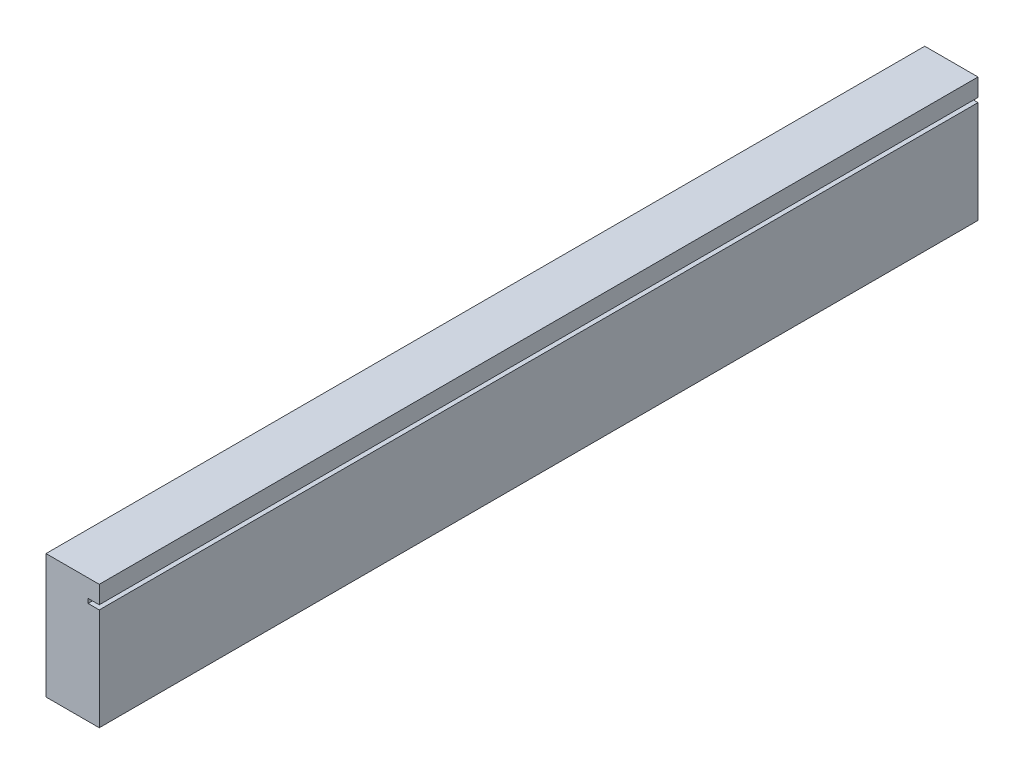
ISO-10303-21;
HEADER;
FILE_DESCRIPTION(('STEP AP214'),'2;1');
FILE_NAME('part.step','',(''),(''),'','','');
FILE_SCHEMA(('AUTOMOTIVE_DESIGN { 1 0 10303 214 1 1 1 1 }'));
ENDSEC;
DATA;
#1=APPLICATION_CONTEXT('core data for automotive mechanical design processes');
#2=APPLICATION_PROTOCOL_DEFINITION('international standard','automotive_design',2000,#1);
#3=PRODUCT_CONTEXT('',#1,'mechanical');
#4=PRODUCT('Part','Part','',(#3));
#5=PRODUCT_RELATED_PRODUCT_CATEGORY('part','',(#4));
#6=PRODUCT_DEFINITION_FORMATION('','',#4);
#7=PRODUCT_DEFINITION_CONTEXT('part definition',#1,'design');
#8=PRODUCT_DEFINITION('design','',#6,#7);
#9=PRODUCT_DEFINITION_SHAPE('','',#8);
#10=(LENGTH_UNIT() NAMED_UNIT(*) SI_UNIT(.MILLI.,.METRE.));
#11=(NAMED_UNIT(*) PLANE_ANGLE_UNIT() SI_UNIT($,.RADIAN.));
#12=(NAMED_UNIT(*) SI_UNIT($,.STERADIAN.) SOLID_ANGLE_UNIT());
#13=UNCERTAINTY_MEASURE_WITH_UNIT(LENGTH_MEASURE(1.E-05),#10,'distance_accuracy_value','');
#14=(GEOMETRIC_REPRESENTATION_CONTEXT(3) GLOBAL_UNCERTAINTY_ASSIGNED_CONTEXT((#13)) GLOBAL_UNIT_ASSIGNED_CONTEXT((#10,
#11,#12)) REPRESENTATION_CONTEXT('',''));
#15=CARTESIAN_POINT('',(0.,0.,0.));
#16=DIRECTION('',(0.,0.,1.));
#17=DIRECTION('',(1.,0.,0.));
#18=AXIS2_PLACEMENT_3D('',#15,#16,#17);
#19=CARTESIAN_POINT('',(19.05,44.45,314.325));
#20=DIRECTION('',(-1.,0.,0.));
#21=DIRECTION('',(0.,-1.,0.));
#22=AXIS2_PLACEMENT_3D('',#19,#20,#21);
#23=PLANE('',#22);
#24=DIRECTION('',(0.,1.,0.));
#25=VECTOR('',#24,1.);
#26=CARTESIAN_POINT('',(19.05,44.45,-314.325));
#27=LINE('',#26,#25);
#28=CARTESIAN_POINT('',(19.05,-44.45,-314.325));
#29=VERTEX_POINT('',#28);
#30=CARTESIAN_POINT('',(19.05,28.575,-314.325));
#31=VERTEX_POINT('',#30);
#32=EDGE_CURVE('E139',#29,#31,#27,.T.);
#33=ORIENTED_EDGE('',*,*,#32,.T.);
#34=DIRECTION('',(0.,0.,1.));
#35=VECTOR('',#34,1.);
#36=CARTESIAN_POINT('',(19.05,28.575,-314.325));
#37=LINE('',#36,#35);
#38=CARTESIAN_POINT('',(19.05,28.575,314.325));
#39=VERTEX_POINT('',#38);
#40=EDGE_CURVE('E165',#31,#39,#37,.T.);
#41=ORIENTED_EDGE('',*,*,#40,.T.);
#42=DIRECTION('',(0.,1.,0.));
#43=VECTOR('',#42,1.);
#44=CARTESIAN_POINT('',(19.05,44.45,314.325));
#45=LINE('',#44,#43);
#46=CARTESIAN_POINT('',(19.05,-44.45,314.325));
#47=VERTEX_POINT('',#46);
#48=EDGE_CURVE('E127',#47,#39,#45,.T.);
#49=ORIENTED_EDGE('',*,*,#48,.F.);
#50=DIRECTION('',(0.,0.,-1.));
#51=VECTOR('',#50,1.);
#52=CARTESIAN_POINT('',(19.05,-44.45,314.325));
#53=LINE('',#52,#51);
#54=EDGE_CURVE('E138',#47,#29,#53,.T.);
#55=ORIENTED_EDGE('',*,*,#54,.T.);
#56=EDGE_LOOP('',(#33,#41,#49,#55));
#57=FACE_BOUND('',#56,.T.);
#58=ADVANCED_FACE('F35',(#57),#23,.F.);
#59=CARTESIAN_POINT('',(19.05,31.75,314.325));
#60=VERTEX_POINT('',#59);
#61=CARTESIAN_POINT('',(19.05,44.45,314.325));
#62=VERTEX_POINT('',#61);
#63=EDGE_CURVE('E87',#60,#62,#45,.T.);
#64=ORIENTED_EDGE('',*,*,#63,.F.);
#65=DIRECTION('',(0.,0.,1.));
#66=VECTOR('',#65,1.);
#67=CARTESIAN_POINT('',(19.05,31.75,-314.325));
#68=LINE('',#67,#66);
#69=CARTESIAN_POINT('',(19.05,31.75,-314.325));
#70=VERTEX_POINT('',#69);
#71=EDGE_CURVE('E110',#70,#60,#68,.T.);
#72=ORIENTED_EDGE('',*,*,#71,.F.);
#73=CARTESIAN_POINT('',(19.05,44.45,-314.325));
#74=VERTEX_POINT('',#73);
#75=EDGE_CURVE('E143',#70,#74,#27,.T.);
#76=ORIENTED_EDGE('',*,*,#75,.T.);
#77=DIRECTION('',(0.,0.,-1.));
#78=VECTOR('',#77,1.);
#79=CARTESIAN_POINT('',(19.05,44.45,314.325));
#80=LINE('',#79,#78);
#81=EDGE_CURVE('E11',#62,#74,#80,.T.);
#82=ORIENTED_EDGE('',*,*,#81,.F.);
#83=EDGE_LOOP('',(#64,#72,#76,#82));
#84=FACE_BOUND('',#83,.T.);
#85=ADVANCED_FACE('F37',(#84),#23,.F.);
#86=CARTESIAN_POINT('',(-19.05,44.45,314.325));
#87=DIRECTION('',(0.,-1.,0.));
#88=DIRECTION('',(0.,0.,-1.));
#89=AXIS2_PLACEMENT_3D('',#86,#87,#88);
#90=PLANE('',#89);
#91=DIRECTION('',(-1.,0.,0.));
#92=VECTOR('',#91,1.);
#93=CARTESIAN_POINT('',(-19.05,44.45,-314.325));
#94=LINE('',#93,#92);
#95=CARTESIAN_POINT('',(-19.05,44.45,-314.325));
#96=VERTEX_POINT('',#95);
#97=EDGE_CURVE('E142',#74,#96,#94,.T.);
#98=ORIENTED_EDGE('',*,*,#97,.T.);
#99=DIRECTION('',(0.,0.,-1.));
#100=VECTOR('',#99,1.);
#101=CARTESIAN_POINT('',(-19.05,44.45,314.325));
#102=LINE('',#101,#100);
#103=CARTESIAN_POINT('',(-19.05,44.45,314.325));
#104=VERTEX_POINT('',#103);
#105=EDGE_CURVE('E43',#104,#96,#102,.T.);
#106=ORIENTED_EDGE('',*,*,#105,.F.);
#107=DIRECTION('',(-1.,0.,0.));
#108=VECTOR('',#107,1.);
#109=CARTESIAN_POINT('',(-19.05,44.45,314.325));
#110=LINE('',#109,#108);
#111=EDGE_CURVE('E129',#62,#104,#110,.T.);
#112=ORIENTED_EDGE('',*,*,#111,.F.);
#113=ORIENTED_EDGE('',*,*,#81,.T.);
#114=EDGE_LOOP('',(#98,#106,#112,#113));
#115=FACE_BOUND('',#114,.T.);
#116=ADVANCED_FACE('F174',(#115),#90,.F.);
#117=CARTESIAN_POINT('',(-19.05,44.45,314.325));
#118=DIRECTION('',(1.,0.,0.));
#119=DIRECTION('',(0.,1.,0.));
#120=AXIS2_PLACEMENT_3D('',#117,#118,#119);
#121=PLANE('',#120);
#122=DIRECTION('',(0.,-1.,0.));
#123=VECTOR('',#122,1.);
#124=CARTESIAN_POINT('',(-19.05,44.45,-314.325));
#125=LINE('',#124,#123);
#126=CARTESIAN_POINT('',(-19.05,-44.45,-314.325));
#127=VERTEX_POINT('',#126);
#128=EDGE_CURVE('E130',#96,#127,#125,.T.);
#129=ORIENTED_EDGE('',*,*,#128,.T.);
#130=DIRECTION('',(0.,0.,-1.));
#131=VECTOR('',#130,1.);
#132=CARTESIAN_POINT('',(-19.05,-44.45,314.325));
#133=LINE('',#132,#131);
#134=CARTESIAN_POINT('',(-19.05,-44.45,314.325));
#135=VERTEX_POINT('',#134);
#136=EDGE_CURVE('E147',#135,#127,#133,.T.);
#137=ORIENTED_EDGE('',*,*,#136,.F.);
#138=DIRECTION('',(0.,-1.,0.));
#139=VECTOR('',#138,1.);
#140=CARTESIAN_POINT('',(-19.05,44.45,314.325));
#141=LINE('',#140,#139);
#142=EDGE_CURVE('E135',#104,#135,#141,.T.);
#143=ORIENTED_EDGE('',*,*,#142,.F.);
#144=ORIENTED_EDGE('',*,*,#105,.T.);
#145=EDGE_LOOP('',(#129,#137,#143,#144));
#146=FACE_BOUND('',#145,.T.);
#147=ADVANCED_FACE('F153',(#146),#121,.F.);
#148=CARTESIAN_POINT('',(-19.05,-44.45,314.325));
#149=DIRECTION('',(0.,1.,0.));
#150=DIRECTION('',(0.,0.,1.));
#151=AXIS2_PLACEMENT_3D('',#148,#149,#150);
#152=PLANE('',#151);
#153=DIRECTION('',(1.,0.,0.));
#154=VECTOR('',#153,1.);
#155=CARTESIAN_POINT('',(-19.05,-44.45,-314.325));
#156=LINE('',#155,#154);
#157=EDGE_CURVE('E80',#127,#29,#156,.T.);
#158=ORIENTED_EDGE('',*,*,#157,.T.);
#159=ORIENTED_EDGE('',*,*,#54,.F.);
#160=DIRECTION('',(1.,0.,0.));
#161=VECTOR('',#160,1.);
#162=CARTESIAN_POINT('',(-19.05,-44.45,314.325));
#163=LINE('',#162,#161);
#164=EDGE_CURVE('E59',#135,#47,#163,.T.);
#165=ORIENTED_EDGE('',*,*,#164,.F.);
#166=ORIENTED_EDGE('',*,*,#136,.T.);
#167=EDGE_LOOP('',(#158,#159,#165,#166));
#168=FACE_BOUND('',#167,.T.);
#169=ADVANCED_FACE('F166',(#168),#152,.F.);
#170=CARTESIAN_POINT('',(0.,0.,314.325));
#171=DIRECTION('',(0.,0.,1.));
#172=DIRECTION('',(1.,0.,0.));
#173=AXIS2_PLACEMENT_3D('',#170,#171,#172);
#174=PLANE('',#173);
#175=DIRECTION('',(1.,0.,0.));
#176=VECTOR('',#175,1.);
#177=CARTESIAN_POINT('',(11.05,28.575,314.325));
#178=LINE('',#177,#176);
#179=CARTESIAN_POINT('',(11.05,28.575,314.325));
#180=VERTEX_POINT('',#179);
#181=EDGE_CURVE('E250',#180,#39,#178,.T.);
#182=ORIENTED_EDGE('',*,*,#181,.F.);
#183=DIRECTION('',(0.,-1.,0.));
#184=VECTOR('',#183,1.);
#185=CARTESIAN_POINT('',(11.05,31.75,314.325));
#186=LINE('',#185,#184);
#187=CARTESIAN_POINT('',(11.05,31.75,314.325));
#188=VERTEX_POINT('',#187);
#189=EDGE_CURVE('E124',#188,#180,#186,.T.);
#190=ORIENTED_EDGE('',*,*,#189,.F.);
#191=DIRECTION('',(-1.,0.,0.));
#192=VECTOR('',#191,1.);
#193=CARTESIAN_POINT('',(19.05,31.75,314.325));
#194=LINE('',#193,#192);
#195=EDGE_CURVE('E112',#60,#188,#194,.T.);
#196=ORIENTED_EDGE('',*,*,#195,.F.);
#197=ORIENTED_EDGE('',*,*,#63,.T.);
#198=ORIENTED_EDGE('',*,*,#111,.T.);
#199=ORIENTED_EDGE('',*,*,#142,.T.);
#200=ORIENTED_EDGE('',*,*,#164,.T.);
#201=ORIENTED_EDGE('',*,*,#48,.T.);
#202=EDGE_LOOP('',(#182,#190,#196,#197,#198,#199,#200,#201));
#203=FACE_BOUND('',#202,.T.);
#204=ADVANCED_FACE('F122',(#203),#174,.T.);
#205=CARTESIAN_POINT('',(0.,0.,-314.325));
#206=DIRECTION('',(0.,0.,1.));
#207=DIRECTION('',(1.,0.,0.));
#208=AXIS2_PLACEMENT_3D('',#205,#206,#207);
#209=PLANE('',#208);
#210=DIRECTION('',(0.,-1.,0.));
#211=VECTOR('',#210,1.);
#212=CARTESIAN_POINT('',(11.05,31.75,-314.325));
#213=LINE('',#212,#211);
#214=CARTESIAN_POINT('',(11.05,31.75,-314.325));
#215=VERTEX_POINT('',#214);
#216=CARTESIAN_POINT('',(11.05,28.575,-314.325));
#217=VERTEX_POINT('',#216);
#218=EDGE_CURVE('E50',#215,#217,#213,.T.);
#219=ORIENTED_EDGE('',*,*,#218,.T.);
#220=DIRECTION('',(1.,0.,0.));
#221=VECTOR('',#220,1.);
#222=CARTESIAN_POINT('',(11.05,28.575,-314.325));
#223=LINE('',#222,#221);
#224=EDGE_CURVE('E119',#217,#31,#223,.T.);
#225=ORIENTED_EDGE('',*,*,#224,.T.);
#226=ORIENTED_EDGE('',*,*,#32,.F.);
#227=ORIENTED_EDGE('',*,*,#157,.F.);
#228=ORIENTED_EDGE('',*,*,#128,.F.);
#229=ORIENTED_EDGE('',*,*,#97,.F.);
#230=ORIENTED_EDGE('',*,*,#75,.F.);
#231=DIRECTION('',(-1.,0.,0.));
#232=VECTOR('',#231,1.);
#233=CARTESIAN_POINT('',(19.05,31.75,-314.325));
#234=LINE('',#233,#232);
#235=EDGE_CURVE('E115',#70,#215,#234,.T.);
#236=ORIENTED_EDGE('',*,*,#235,.T.);
#237=EDGE_LOOP('',(#219,#225,#226,#227,#228,#229,#230,#236));
#238=FACE_BOUND('',#237,.T.);
#239=ADVANCED_FACE('F158',(#238),#209,.F.);
#240=CARTESIAN_POINT('',(11.05,28.575,-314.325));
#241=DIRECTION('',(0.,-1.,0.));
#242=DIRECTION('',(0.,0.,-1.));
#243=AXIS2_PLACEMENT_3D('',#240,#241,#242);
#244=PLANE('',#243);
#245=ORIENTED_EDGE('',*,*,#40,.F.);
#246=ORIENTED_EDGE('',*,*,#224,.F.);
#247=DIRECTION('',(0.,0.,1.));
#248=VECTOR('',#247,1.);
#249=CARTESIAN_POINT('',(11.05,28.575,-314.325));
#250=LINE('',#249,#248);
#251=EDGE_CURVE('E246',#217,#180,#250,.T.);
#252=ORIENTED_EDGE('',*,*,#251,.T.);
#253=ORIENTED_EDGE('',*,*,#181,.T.);
#254=EDGE_LOOP('',(#245,#246,#252,#253));
#255=FACE_BOUND('',#254,.T.);
#256=ADVANCED_FACE('F218',(#255),#244,.F.);
#257=CARTESIAN_POINT('',(11.05,31.75,-314.325));
#258=DIRECTION('',(-1.,0.,0.));
#259=DIRECTION('',(0.,0.,1.));
#260=AXIS2_PLACEMENT_3D('',#257,#258,#259);
#261=PLANE('',#260);
#262=ORIENTED_EDGE('',*,*,#251,.F.);
#263=ORIENTED_EDGE('',*,*,#218,.F.);
#264=DIRECTION('',(0.,0.,1.));
#265=VECTOR('',#264,1.);
#266=CARTESIAN_POINT('',(11.05,31.75,-314.325));
#267=LINE('',#266,#265);
#268=EDGE_CURVE('E118',#215,#188,#267,.T.);
#269=ORIENTED_EDGE('',*,*,#268,.T.);
#270=ORIENTED_EDGE('',*,*,#189,.T.);
#271=EDGE_LOOP('',(#262,#263,#269,#270));
#272=FACE_BOUND('',#271,.T.);
#273=ADVANCED_FACE('F225',(#272),#261,.F.);
#274=CARTESIAN_POINT('',(19.05,31.75,-314.325));
#275=DIRECTION('',(0.,1.,0.));
#276=DIRECTION('',(-1.,0.,0.));
#277=AXIS2_PLACEMENT_3D('',#274,#275,#276);
#278=PLANE('',#277);
#279=ORIENTED_EDGE('',*,*,#268,.F.);
#280=ORIENTED_EDGE('',*,*,#235,.F.);
#281=ORIENTED_EDGE('',*,*,#71,.T.);
#282=ORIENTED_EDGE('',*,*,#195,.T.);
#283=EDGE_LOOP('',(#279,#280,#281,#282));
#284=FACE_BOUND('',#283,.T.);
#285=ADVANCED_FACE('F111',(#284),#278,.F.);
#286=CLOSED_SHELL('',(#58,#85,#116,#147,#169,#204,#239,#256,#273,#285));
#287=MANIFOLD_SOLID_BREP('B2',#286);
#288=ADVANCED_BREP_SHAPE_REPRESENTATION('',(#18,#287),#14);
#289=SHAPE_DEFINITION_REPRESENTATION(#9,#288);
ENDSEC;
END-ISO-10303-21;
